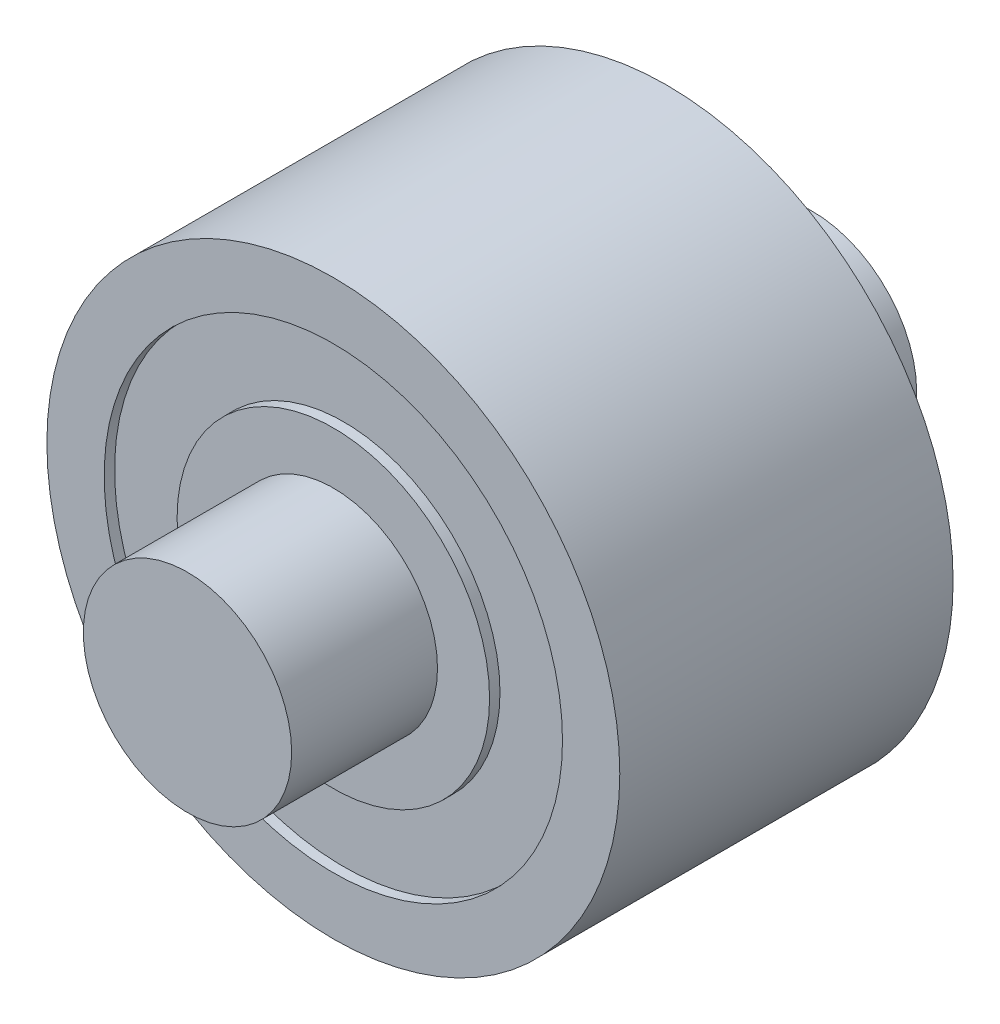
ISO-10303-21;
HEADER;
FILE_DESCRIPTION(('STEP AP214'),'2;1');
FILE_NAME('part.step','',(''),(''),'','','');
FILE_SCHEMA(('AUTOMOTIVE_DESIGN { 1 0 10303 214 1 1 1 1 }'));
ENDSEC;
DATA;
#1=APPLICATION_CONTEXT('core data for automotive mechanical design processes');
#2=APPLICATION_PROTOCOL_DEFINITION('international standard','automotive_design',2000,#1);
#3=PRODUCT_CONTEXT('',#1,'mechanical');
#4=PRODUCT('Part','Part','',(#3));
#5=PRODUCT_RELATED_PRODUCT_CATEGORY('part','',(#4));
#6=PRODUCT_DEFINITION_FORMATION('','',#4);
#7=PRODUCT_DEFINITION_CONTEXT('part definition',#1,'design');
#8=PRODUCT_DEFINITION('design','',#6,#7);
#9=PRODUCT_DEFINITION_SHAPE('','',#8);
#10=(LENGTH_UNIT() NAMED_UNIT(*) SI_UNIT(.MILLI.,.METRE.));
#11=(NAMED_UNIT(*) PLANE_ANGLE_UNIT() SI_UNIT($,.RADIAN.));
#12=(NAMED_UNIT(*) SI_UNIT($,.STERADIAN.) SOLID_ANGLE_UNIT());
#13=UNCERTAINTY_MEASURE_WITH_UNIT(LENGTH_MEASURE(1.E-05),#10,'distance_accuracy_value','');
#14=(GEOMETRIC_REPRESENTATION_CONTEXT(3) GLOBAL_UNCERTAINTY_ASSIGNED_CONTEXT((#13)) GLOBAL_UNIT_ASSIGNED_CONTEXT((#10,
#11,#12)) REPRESENTATION_CONTEXT('',''));
#15=CARTESIAN_POINT('',(0.,0.,0.));
#16=DIRECTION('',(0.,0.,1.));
#17=DIRECTION('',(1.,0.,0.));
#18=AXIS2_PLACEMENT_3D('',#15,#16,#17);
#19=CARTESIAN_POINT('',(0.,0.,12.8));
#20=DIRECTION('',(0.,0.,-1.));
#21=DIRECTION('',(-1.,0.,0.));
#22=AXIS2_PLACEMENT_3D('',#19,#20,#21);
#23=CYLINDRICAL_SURFACE('',#22,11.);
#24=CARTESIAN_POINT('',(0.,0.,12.8));
#25=DIRECTION('',(0.,0.,1.));
#26=DIRECTION('',(1.,0.,0.));
#27=AXIS2_PLACEMENT_3D('',#24,#25,#26);
#28=CIRCLE('',#27,11.);
#29=CARTESIAN_POINT('',(11.,0.,12.8));
#30=VERTEX_POINT('',#29);
#31=EDGE_CURVE('E45',#30,#30,#28,.T.);
#32=ORIENTED_EDGE('',*,*,#31,.F.);
#33=EDGE_LOOP('',(#32));
#34=FACE_BOUND('',#33,.T.);
#35=CARTESIAN_POINT('',(0.,0.,0.));
#36=DIRECTION('',(0.,0.,1.));
#37=DIRECTION('',(1.,0.,0.));
#38=AXIS2_PLACEMENT_3D('',#35,#36,#37);
#39=CIRCLE('',#38,11.);
#40=CARTESIAN_POINT('',(11.,0.,0.));
#41=VERTEX_POINT('',#40);
#42=EDGE_CURVE('E40',#41,#41,#39,.T.);
#43=ORIENTED_EDGE('',*,*,#42,.T.);
#44=EDGE_LOOP('',(#43));
#45=FACE_BOUND('',#44,.T.);
#46=ADVANCED_FACE('F37',(#34,#45),#23,.T.);
#47=CARTESIAN_POINT('',(0.,0.,12.8));
#48=DIRECTION('',(0.,0.,1.));
#49=DIRECTION('',(1.,0.,0.));
#50=AXIS2_PLACEMENT_3D('',#47,#48,#49);
#51=PLANE('',#50);
#52=CARTESIAN_POINT('',(0.,0.,12.8));
#53=DIRECTION('',(0.,0.,1.));
#54=DIRECTION('',(1.,0.,0.));
#55=AXIS2_PLACEMENT_3D('',#52,#53,#54);
#56=CIRCLE('',#55,8.8);
#57=CARTESIAN_POINT('',(8.8,0.,12.8));
#58=VERTEX_POINT('',#57);
#59=EDGE_CURVE('E59',#58,#58,#56,.T.);
#60=ORIENTED_EDGE('',*,*,#59,.F.);
#61=EDGE_LOOP('',(#60));
#62=FACE_BOUND('',#61,.T.);
#63=ORIENTED_EDGE('',*,*,#31,.T.);
#64=EDGE_LOOP('',(#63));
#65=FACE_BOUND('',#64,.T.);
#66=ADVANCED_FACE('F74',(#62,#65),#51,.T.);
#67=CARTESIAN_POINT('',(0.,0.,0.));
#68=DIRECTION('',(0.,0.,1.));
#69=DIRECTION('',(1.,0.,0.));
#70=AXIS2_PLACEMENT_3D('',#67,#68,#69);
#71=PLANE('',#70);
#72=CARTESIAN_POINT('',(0.,0.,0.));
#73=DIRECTION('',(0.,0.,1.));
#74=DIRECTION('',(1.,0.,0.));
#75=AXIS2_PLACEMENT_3D('',#72,#73,#74);
#76=CIRCLE('',#75,8.8);
#77=CARTESIAN_POINT('',(8.8,0.,0.));
#78=VERTEX_POINT('',#77);
#79=EDGE_CURVE('E127',#78,#78,#76,.T.);
#80=ORIENTED_EDGE('',*,*,#79,.T.);
#81=EDGE_LOOP('',(#80));
#82=FACE_BOUND('',#81,.T.);
#83=ORIENTED_EDGE('',*,*,#42,.F.);
#84=EDGE_LOOP('',(#83));
#85=FACE_BOUND('',#84,.T.);
#86=ADVANCED_FACE('F77',(#82,#85),#71,.F.);
#87=CARTESIAN_POINT('',(0.,0.,12.4));
#88=DIRECTION('',(0.,0.,1.));
#89=DIRECTION('',(1.,0.,0.));
#90=AXIS2_PLACEMENT_3D('',#87,#88,#89);
#91=CYLINDRICAL_SURFACE('',#90,8.8);
#92=CARTESIAN_POINT('',(0.,0.,12.4));
#93=DIRECTION('',(0.,0.,1.));
#94=DIRECTION('',(1.,0.,0.));
#95=AXIS2_PLACEMENT_3D('',#92,#93,#94);
#96=CIRCLE('',#95,8.8);
#97=CARTESIAN_POINT('',(8.8,0.,12.4));
#98=VERTEX_POINT('',#97);
#99=EDGE_CURVE('E64',#98,#98,#96,.T.);
#100=ORIENTED_EDGE('',*,*,#99,.F.);
#101=EDGE_LOOP('',(#100));
#102=FACE_BOUND('',#101,.T.);
#103=ORIENTED_EDGE('',*,*,#59,.T.);
#104=EDGE_LOOP('',(#103));
#105=FACE_BOUND('',#104,.T.);
#106=ADVANCED_FACE('F72',(#102,#105),#91,.F.);
#107=CARTESIAN_POINT('',(0.,0.,12.4));
#108=DIRECTION('',(0.,0.,1.));
#109=DIRECTION('',(1.,0.,0.));
#110=AXIS2_PLACEMENT_3D('',#107,#108,#109);
#111=PLANE('',#110);
#112=CARTESIAN_POINT('',(0.,0.,12.4));
#113=DIRECTION('',(0.,0.,1.));
#114=DIRECTION('',(1.,0.,0.));
#115=AXIS2_PLACEMENT_3D('',#112,#113,#114);
#116=CIRCLE('',#115,6.);
#117=CARTESIAN_POINT('',(6.,0.,12.4));
#118=VERTEX_POINT('',#117);
#119=EDGE_CURVE('E55',#118,#118,#116,.T.);
#120=ORIENTED_EDGE('',*,*,#119,.F.);
#121=EDGE_LOOP('',(#120));
#122=FACE_BOUND('',#121,.T.);
#123=ORIENTED_EDGE('',*,*,#99,.T.);
#124=EDGE_LOOP('',(#123));
#125=FACE_BOUND('',#124,.T.);
#126=ADVANCED_FACE('F94',(#122,#125),#111,.T.);
#127=CARTESIAN_POINT('',(0.,0.,12.4));
#128=DIRECTION('',(0.,0.,1.));
#129=DIRECTION('',(1.,0.,0.));
#130=AXIS2_PLACEMENT_3D('',#127,#128,#129);
#131=CYLINDRICAL_SURFACE('',#130,6.);
#132=ORIENTED_EDGE('',*,*,#119,.T.);
#133=EDGE_LOOP('',(#132));
#134=FACE_BOUND('',#133,.T.);
#135=CARTESIAN_POINT('',(0.,0.,12.8));
#136=DIRECTION('',(0.,0.,1.));
#137=DIRECTION('',(1.,0.,0.));
#138=AXIS2_PLACEMENT_3D('',#135,#136,#137);
#139=CIRCLE('',#138,6.);
#140=CARTESIAN_POINT('',(6.,0.,12.8));
#141=VERTEX_POINT('',#140);
#142=EDGE_CURVE('E60',#141,#141,#139,.T.);
#143=ORIENTED_EDGE('',*,*,#142,.F.);
#144=EDGE_LOOP('',(#143));
#145=FACE_BOUND('',#144,.T.);
#146=ADVANCED_FACE('F157',(#134,#145),#131,.T.);
#147=CARTESIAN_POINT('',(0.,0.,12.8));
#148=DIRECTION('',(0.,0.,1.));
#149=DIRECTION('',(1.,0.,0.));
#150=AXIS2_PLACEMENT_3D('',#147,#148,#149);
#151=CIRCLE('',#150,4.);
#152=CARTESIAN_POINT('',(4.,0.,12.8));
#153=VERTEX_POINT('',#152);
#154=EDGE_CURVE('E10',#153,#153,#151,.T.);
#155=ORIENTED_EDGE('',*,*,#154,.F.);
#156=EDGE_LOOP('',(#155));
#157=FACE_BOUND('',#156,.T.);
#158=ORIENTED_EDGE('',*,*,#142,.T.);
#159=EDGE_LOOP('',(#158));
#160=FACE_BOUND('',#159,.T.);
#161=ADVANCED_FACE('F79',(#157,#160),#51,.T.);
#162=CARTESIAN_POINT('',(0.,0.,18.4));
#163=DIRECTION('',(0.,0.,-1.));
#164=DIRECTION('',(-1.,0.,0.));
#165=AXIS2_PLACEMENT_3D('',#162,#163,#164);
#166=CYLINDRICAL_SURFACE('',#165,4.);
#167=CARTESIAN_POINT('',(0.,0.,18.4));
#168=DIRECTION('',(0.,0.,1.));
#169=DIRECTION('',(1.,0.,0.));
#170=AXIS2_PLACEMENT_3D('',#167,#168,#169);
#171=CIRCLE('',#170,4.);
#172=CARTESIAN_POINT('',(4.,0.,18.4));
#173=VERTEX_POINT('',#172);
#174=EDGE_CURVE('E53',#173,#173,#171,.T.);
#175=ORIENTED_EDGE('',*,*,#174,.F.);
#176=EDGE_LOOP('',(#175));
#177=FACE_BOUND('',#176,.T.);
#178=ORIENTED_EDGE('',*,*,#154,.T.);
#179=EDGE_LOOP('',(#178));
#180=FACE_BOUND('',#179,.T.);
#181=ADVANCED_FACE('F152',(#177,#180),#166,.T.);
#182=CARTESIAN_POINT('',(0.,0.,18.4));
#183=DIRECTION('',(0.,0.,1.));
#184=DIRECTION('',(1.,0.,0.));
#185=AXIS2_PLACEMENT_3D('',#182,#183,#184);
#186=PLANE('',#185);
#187=ORIENTED_EDGE('',*,*,#174,.T.);
#188=EDGE_LOOP('',(#187));
#189=FACE_BOUND('',#188,.T.);
#190=ADVANCED_FACE('F146',(#189),#186,.T.);
#191=CARTESIAN_POINT('',(0.,0.,0.4));
#192=DIRECTION('',(0.,0.,-1.));
#193=DIRECTION('',(1.,0.,0.));
#194=AXIS2_PLACEMENT_3D('',#191,#192,#193);
#195=PLANE('',#194);
#196=CARTESIAN_POINT('',(0.,0.,0.4));
#197=DIRECTION('',(0.,0.,1.));
#198=DIRECTION('',(1.,0.,0.));
#199=AXIS2_PLACEMENT_3D('',#196,#197,#198);
#200=CIRCLE('',#199,8.8);
#201=CARTESIAN_POINT('',(8.8,0.,0.4));
#202=VERTEX_POINT('',#201);
#203=EDGE_CURVE('E133',#202,#202,#200,.T.);
#204=ORIENTED_EDGE('',*,*,#203,.F.);
#205=EDGE_LOOP('',(#204));
#206=FACE_BOUND('',#205,.T.);
#207=CARTESIAN_POINT('',(0.,0.,0.4));
#208=DIRECTION('',(0.,0.,1.));
#209=DIRECTION('',(1.,0.,0.));
#210=AXIS2_PLACEMENT_3D('',#207,#208,#209);
#211=CIRCLE('',#210,6.);
#212=CARTESIAN_POINT('',(6.,0.,0.4));
#213=VERTEX_POINT('',#212);
#214=EDGE_CURVE('E121',#213,#213,#211,.T.);
#215=ORIENTED_EDGE('',*,*,#214,.T.);
#216=EDGE_LOOP('',(#215));
#217=FACE_BOUND('',#216,.T.);
#218=ADVANCED_FACE('F140',(#206,#217),#195,.T.);
#219=CARTESIAN_POINT('',(0.,0.,0.4));
#220=DIRECTION('',(0.,0.,-1.));
#221=DIRECTION('',(-1.,0.,0.));
#222=AXIS2_PLACEMENT_3D('',#219,#220,#221);
#223=CYLINDRICAL_SURFACE('',#222,8.8);
#224=ORIENTED_EDGE('',*,*,#203,.T.);
#225=EDGE_LOOP('',(#224));
#226=FACE_BOUND('',#225,.T.);
#227=ORIENTED_EDGE('',*,*,#79,.F.);
#228=EDGE_LOOP('',(#227));
#229=FACE_BOUND('',#228,.T.);
#230=ADVANCED_FACE('F109',(#226,#229),#223,.F.);
#231=CARTESIAN_POINT('',(0.,0.,0.4));
#232=DIRECTION('',(0.,0.,-1.));
#233=DIRECTION('',(-1.,0.,0.));
#234=AXIS2_PLACEMENT_3D('',#231,#232,#233);
#235=CYLINDRICAL_SURFACE('',#234,6.);
#236=ORIENTED_EDGE('',*,*,#214,.F.);
#237=EDGE_LOOP('',(#236));
#238=FACE_BOUND('',#237,.T.);
#239=CARTESIAN_POINT('',(0.,0.,0.));
#240=DIRECTION('',(0.,0.,1.));
#241=DIRECTION('',(1.,0.,0.));
#242=AXIS2_PLACEMENT_3D('',#239,#240,#241);
#243=CIRCLE('',#242,6.);
#244=CARTESIAN_POINT('',(6.,0.,0.));
#245=VERTEX_POINT('',#244);
#246=EDGE_CURVE('E118',#245,#245,#243,.T.);
#247=ORIENTED_EDGE('',*,*,#246,.T.);
#248=EDGE_LOOP('',(#247));
#249=FACE_BOUND('',#248,.T.);
#250=ADVANCED_FACE('F100',(#238,#249),#235,.T.);
#251=CARTESIAN_POINT('',(0.,0.,0.));
#252=DIRECTION('',(0.,0.,1.));
#253=DIRECTION('',(1.,0.,0.));
#254=AXIS2_PLACEMENT_3D('',#251,#252,#253);
#255=CIRCLE('',#254,4.);
#256=CARTESIAN_POINT('',(4.,0.,0.));
#257=VERTEX_POINT('',#256);
#258=EDGE_CURVE('E115',#257,#257,#255,.T.);
#259=ORIENTED_EDGE('',*,*,#258,.T.);
#260=EDGE_LOOP('',(#259));
#261=FACE_BOUND('',#260,.T.);
#262=ORIENTED_EDGE('',*,*,#246,.F.);
#263=EDGE_LOOP('',(#262));
#264=FACE_BOUND('',#263,.T.);
#265=ADVANCED_FACE('F90',(#261,#264),#71,.F.);
#266=CARTESIAN_POINT('',(0.,0.,-5.6));
#267=DIRECTION('',(0.,0.,1.));
#268=DIRECTION('',(1.,0.,0.));
#269=AXIS2_PLACEMENT_3D('',#266,#267,#268);
#270=CYLINDRICAL_SURFACE('',#269,4.);
#271=CARTESIAN_POINT('',(0.,0.,-5.6));
#272=DIRECTION('',(0.,0.,1.));
#273=DIRECTION('',(1.,0.,0.));
#274=AXIS2_PLACEMENT_3D('',#271,#272,#273);
#275=CIRCLE('',#274,4.);
#276=CARTESIAN_POINT('',(4.,0.,-5.6));
#277=VERTEX_POINT('',#276);
#278=EDGE_CURVE('E122',#277,#277,#275,.T.);
#279=ORIENTED_EDGE('',*,*,#278,.T.);
#280=EDGE_LOOP('',(#279));
#281=FACE_BOUND('',#280,.T.);
#282=ORIENTED_EDGE('',*,*,#258,.F.);
#283=EDGE_LOOP('',(#282));
#284=FACE_BOUND('',#283,.T.);
#285=ADVANCED_FACE('F99',(#281,#284),#270,.T.);
#286=CARTESIAN_POINT('',(0.,0.,-5.6));
#287=DIRECTION('',(0.,0.,-1.));
#288=DIRECTION('',(1.,0.,0.));
#289=AXIS2_PLACEMENT_3D('',#286,#287,#288);
#290=PLANE('',#289);
#291=ORIENTED_EDGE('',*,*,#278,.F.);
#292=EDGE_LOOP('',(#291));
#293=FACE_BOUND('',#292,.T.);
#294=ADVANCED_FACE('F106',(#293),#290,.T.);
#295=CLOSED_SHELL('',(#46,#66,#86,#106,#126,#146,#161,#181,#190,#218,#230,#250,#265,#285,#294));
#296=MANIFOLD_SOLID_BREP('B2',#295);
#297=ADVANCED_BREP_SHAPE_REPRESENTATION('',(#18,#296),#14);
#298=SHAPE_DEFINITION_REPRESENTATION(#9,#297);
ENDSEC;
END-ISO-10303-21;
